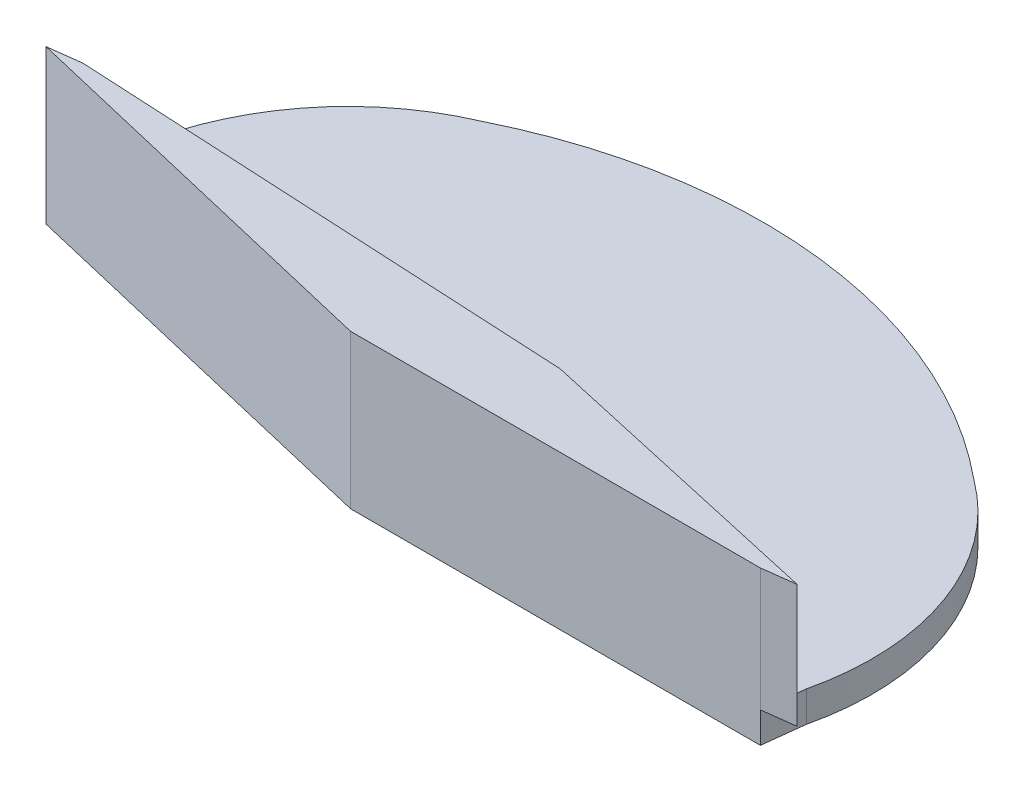
ISO-10303-21;
HEADER;
FILE_DESCRIPTION(('STEP AP214'),'2;1');
FILE_NAME('part.step','',(''),(''),'','','');
FILE_SCHEMA(('AUTOMOTIVE_DESIGN { 1 0 10303 214 1 1 1 1 }'));
ENDSEC;
DATA;
#1=APPLICATION_CONTEXT('core data for automotive mechanical design processes');
#2=APPLICATION_PROTOCOL_DEFINITION('international standard','automotive_design',2000,#1);
#3=PRODUCT_CONTEXT('',#1,'mechanical');
#4=PRODUCT('Part','Part','',(#3));
#5=PRODUCT_RELATED_PRODUCT_CATEGORY('part','',(#4));
#6=PRODUCT_DEFINITION_FORMATION('','',#4);
#7=PRODUCT_DEFINITION_CONTEXT('part definition',#1,'design');
#8=PRODUCT_DEFINITION('design','',#6,#7);
#9=PRODUCT_DEFINITION_SHAPE('','',#8);
#10=(LENGTH_UNIT() NAMED_UNIT(*) SI_UNIT(.MILLI.,.METRE.));
#11=(NAMED_UNIT(*) PLANE_ANGLE_UNIT() SI_UNIT($,.RADIAN.));
#12=(NAMED_UNIT(*) SI_UNIT($,.STERADIAN.) SOLID_ANGLE_UNIT());
#13=UNCERTAINTY_MEASURE_WITH_UNIT(LENGTH_MEASURE(1.E-05),#10,'distance_accuracy_value','');
#14=(GEOMETRIC_REPRESENTATION_CONTEXT(3) GLOBAL_UNCERTAINTY_ASSIGNED_CONTEXT((#13)) GLOBAL_UNIT_ASSIGNED_CONTEXT((#10,
#11,#12)) REPRESENTATION_CONTEXT('',''));
#15=CARTESIAN_POINT('',(0.,0.,0.));
#16=DIRECTION('',(0.,0.,1.));
#17=DIRECTION('',(1.,0.,0.));
#18=AXIS2_PLACEMENT_3D('',#15,#16,#17);
#19=CARTESIAN_POINT('',(12.47,0.5,0.));
#20=DIRECTION('',(0.,-1.,0.));
#21=DIRECTION('',(0.,0.,-1.));
#22=AXIS2_PLACEMENT_3D('',#19,#20,#21);
#23=CYLINDRICAL_SURFACE('',#22,12.47);
#24=DIRECTION('',(0.,-1.,0.));
#25=VECTOR('',#24,1.);
#26=CARTESIAN_POINT('',(7.54800553852922,0.5,-11.4575246245099));
#27=LINE('',#26,#25);
#28=CARTESIAN_POINT('',(7.54800553852922,0.5,-11.4575246245099));
#29=VERTEX_POINT('',#28);
#30=CARTESIAN_POINT('',(7.54800553852922,-1.,-11.4575246245099));
#31=VERTEX_POINT('',#30);
#32=EDGE_CURVE('E138',#29,#31,#27,.T.);
#33=ORIENTED_EDGE('',*,*,#32,.T.);
#34=CARTESIAN_POINT('',(12.47,-1.,0.));
#35=DIRECTION('',(0.,-1.,0.));
#36=DIRECTION('',(0.,0.,-1.));
#37=AXIS2_PLACEMENT_3D('',#34,#35,#36);
#38=CIRCLE('',#37,12.47);
#39=CARTESIAN_POINT('',(0.,-1.,0.));
#40=VERTEX_POINT('',#39);
#41=EDGE_CURVE('E152',#40,#31,#38,.T.);
#42=ORIENTED_EDGE('',*,*,#41,.F.);
#43=DIRECTION('',(0.,-1.,0.));
#44=VECTOR('',#43,1.);
#45=CARTESIAN_POINT('',(0.,0.5,0.));
#46=LINE('',#45,#44);
#47=CARTESIAN_POINT('',(0.,0.5,0.));
#48=VERTEX_POINT('',#47);
#49=EDGE_CURVE('E38',#48,#40,#46,.T.);
#50=ORIENTED_EDGE('',*,*,#49,.F.);
#51=CARTESIAN_POINT('',(12.47,0.5,0.));
#52=DIRECTION('',(0.,1.,0.));
#53=DIRECTION('',(0.,0.,1.));
#54=AXIS2_PLACEMENT_3D('',#51,#52,#53);
#55=CIRCLE('',#54,12.47);
#56=EDGE_CURVE('E216',#29,#48,#55,.T.);
#57=ORIENTED_EDGE('',*,*,#56,.F.);
#58=EDGE_LOOP('',(#33,#42,#50,#57));
#59=FACE_BOUND('',#58,.T.);
#60=ADVANCED_FACE('F35',(#59),#23,.T.);
#61=CARTESIAN_POINT('',(27.3280369120115,0.5,1.73227452102643));
#62=DIRECTION('',(0.,-1.,0.));
#63=DIRECTION('',(0.,0.,-1.));
#64=AXIS2_PLACEMENT_3D('',#61,#62,#63);
#65=CYLINDRICAL_SURFACE('',#64,12.47);
#66=DIRECTION('',(0.,-1.,0.));
#67=VECTOR('',#66,1.);
#68=CARTESIAN_POINT('',(39.4635774555418,0.5,4.6009947437621));
#69=LINE('',#68,#67);
#70=CARTESIAN_POINT('',(39.4635774555418,0.5,4.6009947437621));
#71=VERTEX_POINT('',#70);
#72=CARTESIAN_POINT('',(39.4635774555418,-1.,4.6009947437621));
#73=VERTEX_POINT('',#72);
#74=EDGE_CURVE('E137',#71,#73,#69,.T.);
#75=ORIENTED_EDGE('',*,*,#74,.T.);
#76=CARTESIAN_POINT('',(27.3280369120115,-1.,1.73227452102643));
#77=DIRECTION('',(0.,-1.,0.));
#78=DIRECTION('',(0.,0.,-1.));
#79=AXIS2_PLACEMENT_3D('',#76,#77,#78);
#80=CIRCLE('',#79,12.47);
#81=CARTESIAN_POINT('',(34.7538184625354,-1.,-8.2856428455672));
#82=VERTEX_POINT('',#81);
#83=EDGE_CURVE('E141',#82,#73,#80,.T.);
#84=ORIENTED_EDGE('',*,*,#83,.F.);
#85=DIRECTION('',(0.,-1.,0.));
#86=VECTOR('',#85,1.);
#87=CARTESIAN_POINT('',(34.7538184625354,0.5,-8.2856428455672));
#88=LINE('',#87,#86);
#89=CARTESIAN_POINT('',(34.7538184625354,0.5,-8.2856428455672));
#90=VERTEX_POINT('',#89);
#91=EDGE_CURVE('E128',#90,#82,#88,.T.);
#92=ORIENTED_EDGE('',*,*,#91,.F.);
#93=CARTESIAN_POINT('',(27.3280369120115,0.5,1.73227452102643));
#94=DIRECTION('',(0.,1.,0.));
#95=DIRECTION('',(0.,0.,1.));
#96=AXIS2_PLACEMENT_3D('',#93,#94,#95);
#97=CIRCLE('',#96,12.47);
#98=EDGE_CURVE('E222',#71,#90,#97,.T.);
#99=ORIENTED_EDGE('',*,*,#98,.F.);
#100=EDGE_LOOP('',(#75,#84,#92,#99));
#101=FACE_BOUND('',#100,.T.);
#102=ADVANCED_FACE('F142',(#101),#65,.T.);
#103=CARTESIAN_POINT('',(18.7047366417437,0.5,11.1097118581097));
#104=DIRECTION('',(0.,-1.,0.));
#105=DIRECTION('',(0.,0.,-1.));
#106=AXIS2_PLACEMENT_3D('',#103,#104,#105);
#107=CYLINDRICAL_SURFACE('',#106,25.1744475882175);
#108=ORIENTED_EDGE('',*,*,#91,.T.);
#109=CARTESIAN_POINT('',(18.7047366417437,-1.,11.1097118581097));
#110=DIRECTION('',(0.,-1.,0.));
#111=DIRECTION('',(0.,0.,-1.));
#112=AXIS2_PLACEMENT_3D('',#109,#110,#111);
#113=CIRCLE('',#112,25.1744475882175);
#114=EDGE_CURVE('E133',#31,#82,#113,.T.);
#115=ORIENTED_EDGE('',*,*,#114,.F.);
#116=ORIENTED_EDGE('',*,*,#32,.F.);
#117=CARTESIAN_POINT('',(18.7047366417437,0.5,11.1097118581097));
#118=DIRECTION('',(0.,1.,0.));
#119=DIRECTION('',(0.,0.,-1.));
#120=AXIS2_PLACEMENT_3D('',#117,#118,#119);
#121=CIRCLE('',#120,25.1744475882175);
#122=EDGE_CURVE('E134',#90,#29,#121,.T.);
#123=ORIENTED_EDGE('',*,*,#122,.F.);
#124=EDGE_LOOP('',(#108,#115,#116,#123));
#125=FACE_BOUND('',#124,.T.);
#126=ADVANCED_FACE('F130',(#125),#107,.T.);
#127=CARTESIAN_POINT('',(12.47,0.5,0.));
#128=DIRECTION('',(0.,1.,0.));
#129=DIRECTION('',(0.,0.,1.));
#130=AXIS2_PLACEMENT_3D('',#127,#128,#129);
#131=PLANE('',#130);
#132=DIRECTION('',(-0.992062003726637,0.,0.125749674997158));
#133=VECTOR('',#132,1.);
#134=CARTESIAN_POINT('',(-0.235136986832448,0.5,2.01681445185956));
#135=LINE('',#134,#133);
#136=CARTESIAN_POINT('',(1.36009864005399,0.5,1.81460898398426));
#137=VERTEX_POINT('',#136);
#138=CARTESIAN_POINT('',(-0.23513699292276,0.5,2.01681441362274));
#139=VERTEX_POINT('',#138);
#140=EDGE_CURVE('E53',#137,#139,#135,.T.);
#141=ORIENTED_EDGE('',*,*,#140,.F.);
#142=DIRECTION('',(-0.998658523032324,0.,-0.0517798645700874));
#143=VECTOR('',#142,1.);
#144=CARTESIAN_POINT('',(25.9265759958237,0.5,3.08836657089537));
#145=LINE('',#144,#143);
#146=CARTESIAN_POINT('',(18.2272465806895,0.5,2.6891608111672));
#147=VERTEX_POINT('',#146);
#148=EDGE_CURVE('E11',#147,#137,#145,.T.);
#149=ORIENTED_EDGE('',*,*,#148,.F.);
#150=CARTESIAN_POINT('',(19.6221740522492,0.5,3.24068356599061));
#151=DIRECTION('',(0.,-1.,0.));
#152=DIRECTION('',(0.,0.,-1.));
#153=AXIS2_PLACEMENT_3D('',#150,#151,#152);
#154=CIRCLE('',#153,1.5);
#155=CARTESIAN_POINT('',(21.0666604199361,0.5,2.83638277008885));
#156=VERTEX_POINT('',#155);
#157=EDGE_CURVE('E201',#147,#156,#154,.T.);
#158=ORIENTED_EDGE('',*,*,#157,.T.);
#159=CARTESIAN_POINT('',(25.9265759958237,0.5,3.08836657089537));
#160=VERTEX_POINT('',#159);
#161=EDGE_CURVE('E45',#160,#156,#145,.T.);
#162=ORIENTED_EDGE('',*,*,#161,.F.);
#163=DIRECTION('',(-0.975953859168826,0.,-0.217977211592121));
#164=VECTOR('',#163,1.);
#165=CARTESIAN_POINT('',(25.9265759958237,0.5,3.08836657089537));
#166=LINE('',#165,#164);
#167=CARTESIAN_POINT('',(39.2919024489741,0.5,6.07348371030328));
#168=VERTEX_POINT('',#167);
#169=EDGE_CURVE('E43',#168,#160,#166,.T.);
#170=ORIENTED_EDGE('',*,*,#169,.F.);
#171=DIRECTION('',(-0.115803919146577,0.,0.993272093794189));
#172=VECTOR('',#171,1.);
#173=CARTESIAN_POINT('',(39.4635777739767,0.5,4.60099201248594));
#174=LINE('',#173,#172);
#175=EDGE_CURVE('E206',#71,#168,#174,.T.);
#176=ORIENTED_EDGE('',*,*,#175,.F.);
#177=ORIENTED_EDGE('',*,*,#98,.T.);
#178=ORIENTED_EDGE('',*,*,#122,.T.);
#179=ORIENTED_EDGE('',*,*,#56,.T.);
#180=DIRECTION('',(0.115803919146596,0.,-0.993272093794187));
#181=VECTOR('',#180,1.);
#182=CARTESIAN_POINT('',(0.,0.5,0.));
#183=LINE('',#182,#181);
#184=EDGE_CURVE('E209',#139,#48,#183,.T.);
#185=ORIENTED_EDGE('',*,*,#184,.F.);
#186=EDGE_LOOP('',(#141,#149,#158,#162,#170,#176,#177,#178,#179,#185));
#187=FACE_BOUND('',#186,.T.);
#188=ADVANCED_FACE('F276',(#187),#131,.T.);
#189=CARTESIAN_POINT('',(0.,0.5,0.));
#190=DIRECTION('',(-0.993272093794187,0.,-0.115803919146596));
#191=DIRECTION('',(-0.115803919146596,0.,0.993272093794187));
#192=AXIS2_PLACEMENT_3D('',#189,#190,#191);
#193=PLANE('',#192);
#194=ORIENTED_EDGE('',*,*,#49,.T.);
#195=DIRECTION('',(0.115803919146597,0.,-0.993272093794187));
#196=VECTOR('',#195,1.);
#197=CARTESIAN_POINT('',(-0.23513699292276,-1.,2.01681441362274));
#198=LINE('',#197,#196);
#199=CARTESIAN_POINT('',(-0.23513699292276,-1.,2.01681441362274));
#200=VERTEX_POINT('',#199);
#201=EDGE_CURVE('E162',#200,#40,#198,.T.);
#202=ORIENTED_EDGE('',*,*,#201,.F.);
#203=DIRECTION('',(0.,-1.,0.));
#204=VECTOR('',#203,1.);
#205=CARTESIAN_POINT('',(-0.23513699292276,0.5,2.01681441362274));
#206=LINE('',#205,#204);
#207=EDGE_CURVE('E214',#139,#200,#206,.T.);
#208=ORIENTED_EDGE('',*,*,#207,.F.);
#209=ORIENTED_EDGE('',*,*,#184,.T.);
#210=EDGE_LOOP('',(#194,#202,#208,#209));
#211=FACE_BOUND('',#210,.T.);
#212=ADVANCED_FACE('F283',(#211),#193,.T.);
#213=CARTESIAN_POINT('',(-0.463967570289514,0.5,1.96272116341072));
#214=DIRECTION('',(-0.23004971269634,0.,0.973178878566696));
#215=DIRECTION('',(0.973178878566696,0.,0.23004971269634));
#216=AXIS2_PLACEMENT_3D('',#213,#214,#215);
#217=PLANE('',#216);
#218=ORIENTED_EDGE('',*,*,#207,.T.);
#219=DIRECTION('',(-0.973178878566696,0.,-0.23004971269634));
#220=VECTOR('',#219,1.);
#221=CARTESIAN_POINT('',(19.2284405784112,-1.,6.61780866754955));
#222=LINE('',#221,#220);
#223=CARTESIAN_POINT('',(19.2284405784112,-1.,6.61780866754955));
#224=VERTEX_POINT('',#223);
#225=EDGE_CURVE('E159',#224,#200,#222,.T.);
#226=ORIENTED_EDGE('',*,*,#225,.F.);
#227=DIRECTION('',(0.,-1.,0.));
#228=VECTOR('',#227,1.);
#229=CARTESIAN_POINT('',(19.2284405784112,0.5,6.61780866754955));
#230=LINE('',#229,#228);
#231=CARTESIAN_POINT('',(19.2284405931345,6.5,6.61780866926612));
#232=VERTEX_POINT('',#231);
#233=EDGE_CURVE('E217',#232,#224,#230,.T.);
#234=ORIENTED_EDGE('',*,*,#233,.F.);
#235=DIRECTION('',(0.973178878998347,0.,0.230049710870328));
#236=VECTOR('',#235,1.);
#237=CARTESIAN_POINT('',(19.2284405931345,6.5,6.61780866926612));
#238=LINE('',#237,#236);
#239=CARTESIAN_POINT('',(-0.235136986832448,6.5,2.01681445185956));
#240=VERTEX_POINT('',#239);
#241=EDGE_CURVE('E166',#240,#232,#238,.T.);
#242=ORIENTED_EDGE('',*,*,#241,.F.);
#243=DIRECTION('',(0.,-1.,0.));
#244=VECTOR('',#243,1.);
#245=CARTESIAN_POINT('',(-0.235136986832448,6.5,2.01681445185956));
#246=LINE('',#245,#244);
#247=EDGE_CURVE('E179',#240,#139,#246,.T.);
#248=ORIENTED_EDGE('',*,*,#247,.T.);
#249=EDGE_LOOP('',(#218,#226,#234,#242,#248));
#250=FACE_BOUND('',#249,.T.);
#251=ADVANCED_FACE('F281',(#250),#217,.T.);
#252=CARTESIAN_POINT('',(1.66548900710995E-07,0.5,6.61780915146734));
#253=DIRECTION('',(-2.51667730058469E-08,0.,-1.));
#254=DIRECTION('',(-1.,0.,2.51667730058469E-08));
#255=AXIS2_PLACEMENT_3D('',#252,#253,#254);
#256=PLANE('',#255);
#257=ORIENTED_EDGE('',*,*,#233,.T.);
#258=DIRECTION('',(-1.,0.,2.51667730925831E-08));
#259=VECTOR('',#258,1.);
#260=CARTESIAN_POINT('',(39.2284405784111,-1.,6.61780816421408));
#261=LINE('',#260,#259);
#262=CARTESIAN_POINT('',(39.2284405784111,-1.,6.61780816421408));
#263=VERTEX_POINT('',#262);
#264=EDGE_CURVE('E156',#263,#224,#261,.T.);
#265=ORIENTED_EDGE('',*,*,#264,.F.);
#266=DIRECTION('',(0.,-1.,0.));
#267=VECTOR('',#266,1.);
#268=CARTESIAN_POINT('',(39.2284405784111,0.5,6.61780816421408));
#269=LINE('',#268,#267);
#270=CARTESIAN_POINT('',(39.2284405784111,0.5,6.61780816421408));
#271=VERTEX_POINT('',#270);
#272=EDGE_CURVE('E211',#271,#263,#269,.T.);
#273=ORIENTED_EDGE('',*,*,#272,.F.);
#274=DIRECTION('',(0.,-1.,0.));
#275=VECTOR('',#274,1.);
#276=CARTESIAN_POINT('',(39.2284405931345,6.5,6.6178081284039));
#277=LINE('',#276,#275);
#278=CARTESIAN_POINT('',(39.2284405931345,6.5,6.6178081284039));
#279=VERTEX_POINT('',#278);
#280=EDGE_CURVE('E198',#279,#271,#277,.T.);
#281=ORIENTED_EDGE('',*,*,#280,.F.);
#282=DIRECTION('',(1.,0.,-2.70431109363617E-08));
#283=VECTOR('',#282,1.);
#284=CARTESIAN_POINT('',(39.2284405931345,6.5,6.6178081284039));
#285=LINE('',#284,#283);
#286=EDGE_CURVE('E169',#232,#279,#285,.T.);
#287=ORIENTED_EDGE('',*,*,#286,.F.);
#288=EDGE_LOOP('',(#257,#265,#273,#281,#287));
#289=FACE_BOUND('',#288,.T.);
#290=ADVANCED_FACE('F257',(#289),#256,.F.);
#291=CARTESIAN_POINT('',(19.6221740522492,0.5,3.24068356599061));
#292=DIRECTION('',(0.,-1.,0.));
#293=DIRECTION('',(0.,0.,-1.));
#294=AXIS2_PLACEMENT_3D('',#291,#292,#293);
#295=CYLINDRICAL_SURFACE('',#294,1.5);
#296=EDGE_CURVE('E202',#156,#147,#154,.T.);
#297=ORIENTED_EDGE('',*,*,#296,.F.);
#298=ORIENTED_EDGE('',*,*,#157,.F.);
#299=EDGE_LOOP('',(#297,#298));
#300=FACE_BOUND('',#299,.T.);
#301=CARTESIAN_POINT('',(19.6221740522492,0.,3.24068356599061));
#302=DIRECTION('',(0.,-1.,0.));
#303=DIRECTION('',(0.,0.,-1.));
#304=AXIS2_PLACEMENT_3D('',#301,#302,#303);
#305=CIRCLE('',#304,1.5);
#306=CARTESIAN_POINT('',(19.6221740522492,0.,1.74068356599061));
#307=VERTEX_POINT('',#306);
#308=EDGE_CURVE('E165',#307,#307,#305,.T.);
#309=ORIENTED_EDGE('',*,*,#308,.T.);
#310=EDGE_LOOP('',(#309));
#311=FACE_BOUND('',#310,.T.);
#312=ADVANCED_FACE('F294',(#300,#311),#295,.F.);
#313=CARTESIAN_POINT('',(39.4635777739767,0.5,4.60099201248594));
#314=DIRECTION('',(0.99327209379419,0.,0.115803919146577));
#315=DIRECTION('',(0.115803919146577,0.,-0.99327209379419));
#316=AXIS2_PLACEMENT_3D('',#313,#314,#315);
#317=PLANE('',#316);
#318=ORIENTED_EDGE('',*,*,#272,.T.);
#319=DIRECTION('',(-0.115803919146577,0.,0.993272093794189));
#320=VECTOR('',#319,1.);
#321=CARTESIAN_POINT('',(39.4635774555418,-1.,4.6009947437621));
#322=LINE('',#321,#320);
#323=EDGE_CURVE('E146',#73,#263,#322,.T.);
#324=ORIENTED_EDGE('',*,*,#323,.F.);
#325=ORIENTED_EDGE('',*,*,#74,.F.);
#326=ORIENTED_EDGE('',*,*,#175,.T.);
#327=EDGE_CURVE('E205',#168,#271,#174,.T.);
#328=ORIENTED_EDGE('',*,*,#327,.T.);
#329=EDGE_LOOP('',(#318,#324,#325,#326,#328));
#330=FACE_BOUND('',#329,.T.);
#331=ADVANCED_FACE('F253',(#330),#317,.T.);
#332=CARTESIAN_POINT('',(0.,0.5,0.));
#333=DIRECTION('',(0.,-1.,0.));
#334=DIRECTION('',(0.,0.,-1.));
#335=AXIS2_PLACEMENT_3D('',#332,#333,#334);
#336=PLANE('',#335);
#337=ORIENTED_EDGE('',*,*,#327,.F.);
#338=CARTESIAN_POINT('',(40.8236777839302,0.5,6.41560246229393));
#339=VERTEX_POINT('',#338);
#340=EDGE_CURVE('E182',#339,#168,#166,.T.);
#341=ORIENTED_EDGE('',*,*,#340,.F.);
#342=DIRECTION('',(0.992062003726637,0.,-0.125749674997158));
#343=VECTOR('',#342,1.);
#344=CARTESIAN_POINT('',(40.8236777839302,0.5,6.41560246229393));
#345=LINE('',#344,#343);
#346=EDGE_CURVE('E180',#271,#339,#345,.T.);
#347=ORIENTED_EDGE('',*,*,#346,.F.);
#348=EDGE_LOOP('',(#337,#341,#347));
#349=FACE_BOUND('',#348,.T.);
#350=ADVANCED_FACE('F250',(#349),#336,.T.);
#351=CARTESIAN_POINT('',(40.8236777839302,6.5,6.41560246229393));
#352=DIRECTION('',(-0.125749674997158,0.,-0.992062003726637));
#353=DIRECTION('',(-0.992062003726637,0.,0.125749674997158));
#354=AXIS2_PLACEMENT_3D('',#351,#352,#353);
#355=PLANE('',#354);
#356=ORIENTED_EDGE('',*,*,#346,.T.);
#357=DIRECTION('',(0.,-1.,0.));
#358=VECTOR('',#357,1.);
#359=CARTESIAN_POINT('',(40.8236777839302,6.5,6.41560246229393));
#360=LINE('',#359,#358);
#361=CARTESIAN_POINT('',(40.8236777839302,6.5,6.41560246229393));
#362=VERTEX_POINT('',#361);
#363=EDGE_CURVE('E195',#362,#339,#360,.T.);
#364=ORIENTED_EDGE('',*,*,#363,.F.);
#365=DIRECTION('',(0.992062003726637,0.,-0.125749674997158));
#366=VECTOR('',#365,1.);
#367=CARTESIAN_POINT('',(40.8236777839302,6.5,6.41560246229393));
#368=LINE('',#367,#366);
#369=EDGE_CURVE('E171',#279,#362,#368,.T.);
#370=ORIENTED_EDGE('',*,*,#369,.F.);
#371=ORIENTED_EDGE('',*,*,#280,.T.);
#372=EDGE_LOOP('',(#356,#364,#370,#371));
#373=FACE_BOUND('',#372,.T.);
#374=ADVANCED_FACE('F259',(#373),#355,.F.);
#375=CARTESIAN_POINT('',(25.9265759958237,6.5,3.08836657089537));
#376=DIRECTION('',(-0.217977211592121,0.,0.975953859168825));
#377=DIRECTION('',(0.975953859168826,0.,0.217977211592121));
#378=AXIS2_PLACEMENT_3D('',#375,#376,#377);
#379=PLANE('',#378);
#380=ORIENTED_EDGE('',*,*,#340,.T.);
#381=ORIENTED_EDGE('',*,*,#169,.T.);
#382=DIRECTION('',(0.,-1.,0.));
#383=VECTOR('',#382,1.);
#384=CARTESIAN_POINT('',(25.9265759958237,6.5,3.08836657089537));
#385=LINE('',#384,#383);
#386=CARTESIAN_POINT('',(25.9265759958237,6.5,3.08836657089537));
#387=VERTEX_POINT('',#386);
#388=EDGE_CURVE('E192',#387,#160,#385,.T.);
#389=ORIENTED_EDGE('',*,*,#388,.F.);
#390=DIRECTION('',(-0.975953859168826,0.,-0.217977211592121));
#391=VECTOR('',#390,1.);
#392=CARTESIAN_POINT('',(25.9265759958237,6.5,3.08836657089537));
#393=LINE('',#392,#391);
#394=EDGE_CURVE('E173',#362,#387,#393,.T.);
#395=ORIENTED_EDGE('',*,*,#394,.F.);
#396=ORIENTED_EDGE('',*,*,#363,.T.);
#397=EDGE_LOOP('',(#380,#381,#389,#395,#396));
#398=FACE_BOUND('',#397,.T.);
#399=ADVANCED_FACE('F231',(#398),#379,.F.);
#400=CARTESIAN_POINT('',(25.9265759958237,6.5,3.08836657089537));
#401=DIRECTION('',(-0.0517798645700874,0.,0.998658523032324));
#402=DIRECTION('',(0.998658523032324,0.,0.0517798645700874));
#403=AXIS2_PLACEMENT_3D('',#400,#401,#402);
#404=PLANE('',#403);
#405=ORIENTED_EDGE('',*,*,#161,.T.);
#406=EDGE_CURVE('E46',#156,#147,#145,.T.);
#407=ORIENTED_EDGE('',*,*,#406,.T.);
#408=ORIENTED_EDGE('',*,*,#148,.T.);
#409=DIRECTION('',(0.,-1.,0.));
#410=VECTOR('',#409,1.);
#411=CARTESIAN_POINT('',(1.36009864005399,6.5,1.81460898398426));
#412=LINE('',#411,#410);
#413=CARTESIAN_POINT('',(1.36009864005399,6.5,1.81460898398426));
#414=VERTEX_POINT('',#413);
#415=EDGE_CURVE('E189',#414,#137,#412,.T.);
#416=ORIENTED_EDGE('',*,*,#415,.F.);
#417=DIRECTION('',(-0.998658523032324,0.,-0.0517798645700874));
#418=VECTOR('',#417,1.);
#419=CARTESIAN_POINT('',(25.9265759958237,6.5,3.08836657089537));
#420=LINE('',#419,#418);
#421=EDGE_CURVE('E175',#387,#414,#420,.T.);
#422=ORIENTED_EDGE('',*,*,#421,.F.);
#423=ORIENTED_EDGE('',*,*,#388,.T.);
#424=EDGE_LOOP('',(#405,#407,#408,#416,#422,#423));
#425=FACE_BOUND('',#424,.T.);
#426=ADVANCED_FACE('F237',(#425),#404,.F.);
#427=CARTESIAN_POINT('',(-0.235136986832448,6.5,2.01681445185956));
#428=DIRECTION('',(0.125749674997158,0.,0.992062003726637));
#429=DIRECTION('',(0.992062003726637,0.,-0.125749674997158));
#430=AXIS2_PLACEMENT_3D('',#427,#428,#429);
#431=PLANE('',#430);
#432=ORIENTED_EDGE('',*,*,#140,.T.);
#433=ORIENTED_EDGE('',*,*,#247,.F.);
#434=DIRECTION('',(-0.992062003726637,0.,0.125749674997158));
#435=VECTOR('',#434,1.);
#436=CARTESIAN_POINT('',(-0.235136986832448,6.5,2.01681445185956));
#437=LINE('',#436,#435);
#438=EDGE_CURVE('E177',#414,#240,#437,.T.);
#439=ORIENTED_EDGE('',*,*,#438,.F.);
#440=ORIENTED_EDGE('',*,*,#415,.T.);
#441=EDGE_LOOP('',(#432,#433,#439,#440));
#442=FACE_BOUND('',#441,.T.);
#443=ADVANCED_FACE('F278',(#442),#431,.F.);
#444=CARTESIAN_POINT('',(0.,6.5,0.));
#445=DIRECTION('',(0.,-1.,0.));
#446=DIRECTION('',(0.,0.,-1.));
#447=AXIS2_PLACEMENT_3D('',#444,#445,#446);
#448=PLANE('',#447);
#449=ORIENTED_EDGE('',*,*,#241,.T.);
#450=ORIENTED_EDGE('',*,*,#286,.T.);
#451=ORIENTED_EDGE('',*,*,#369,.T.);
#452=ORIENTED_EDGE('',*,*,#394,.T.);
#453=ORIENTED_EDGE('',*,*,#421,.T.);
#454=ORIENTED_EDGE('',*,*,#438,.T.);
#455=EDGE_LOOP('',(#449,#450,#451,#452,#453,#454));
#456=FACE_BOUND('',#455,.T.);
#457=ADVANCED_FACE('F242',(#456),#448,.F.);
#458=ORIENTED_EDGE('',*,*,#406,.F.);
#459=ORIENTED_EDGE('',*,*,#296,.T.);
#460=EDGE_LOOP('',(#458,#459));
#461=FACE_BOUND('',#460,.T.);
#462=ADVANCED_FACE('F268',(#461),#336,.T.);
#463=CARTESIAN_POINT('',(18.7047366417437,0.,11.1097118581097));
#464=DIRECTION('',(0.,-1.,0.));
#465=DIRECTION('',(0.,0.,-1.));
#466=AXIS2_PLACEMENT_3D('',#463,#464,#465);
#467=PLANE('',#466);
#468=ORIENTED_EDGE('',*,*,#308,.F.);
#469=EDGE_LOOP('',(#468));
#470=FACE_BOUND('',#469,.T.);
#471=ADVANCED_FACE('F368',(#470),#467,.F.);
#472=CARTESIAN_POINT('',(18.7047366417437,-1.,11.1097118581097));
#473=DIRECTION('',(0.,-1.,0.));
#474=DIRECTION('',(0.,0.,-1.));
#475=AXIS2_PLACEMENT_3D('',#472,#473,#474);
#476=PLANE('',#475);
#477=ORIENTED_EDGE('',*,*,#114,.T.);
#478=ORIENTED_EDGE('',*,*,#83,.T.);
#479=ORIENTED_EDGE('',*,*,#323,.T.);
#480=ORIENTED_EDGE('',*,*,#264,.T.);
#481=ORIENTED_EDGE('',*,*,#225,.T.);
#482=ORIENTED_EDGE('',*,*,#201,.T.);
#483=ORIENTED_EDGE('',*,*,#41,.T.);
#484=EDGE_LOOP('',(#477,#478,#479,#480,#481,#482,#483));
#485=FACE_BOUND('',#484,.T.);
#486=ADVANCED_FACE('F149',(#485),#476,.T.);
#487=CLOSED_SHELL('',(#60,#102,#126,#188,#212,#251,#290,#312,#331,#350,#374,#399,#426,#443,#457,
#462,#471,#486));
#488=MANIFOLD_SOLID_BREP('B2',#487);
#489=ADVANCED_BREP_SHAPE_REPRESENTATION('',(#18,#488),#14);
#490=SHAPE_DEFINITION_REPRESENTATION(#9,#489);
ENDSEC;
END-ISO-10303-21;
